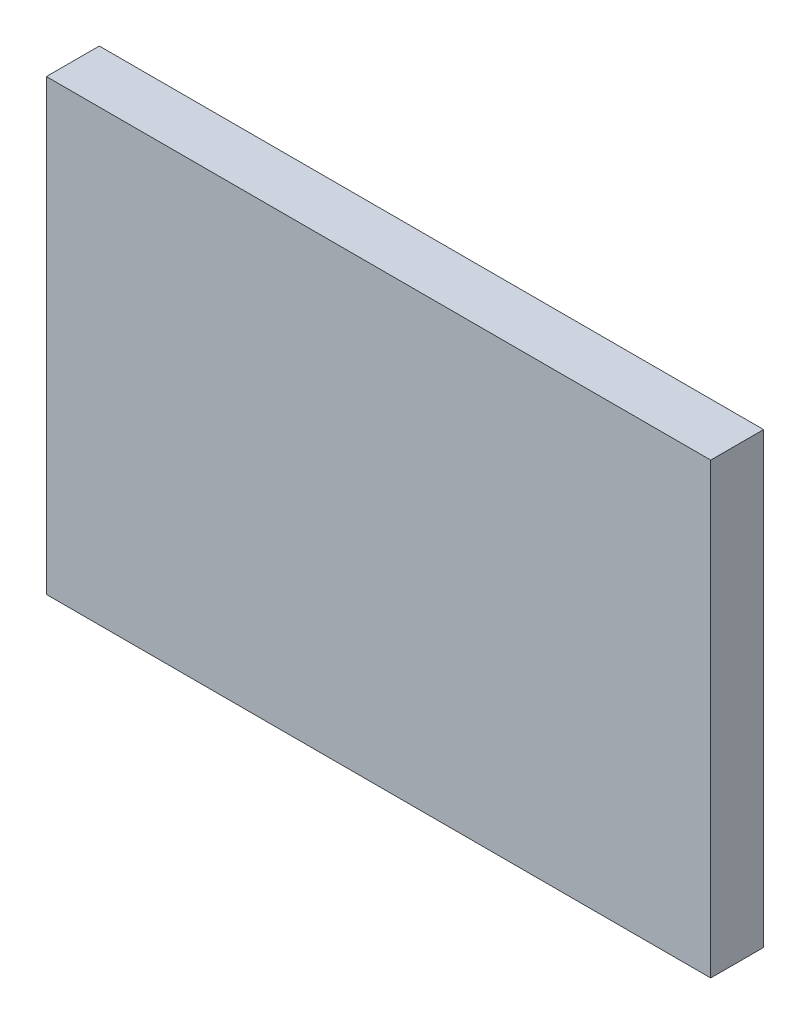
ISO-10303-21;
HEADER;
FILE_DESCRIPTION(('STEP AP214'),'2;1');
FILE_NAME('part.step','',(''),(''),'','','');
FILE_SCHEMA(('AUTOMOTIVE_DESIGN { 1 0 10303 214 1 1 1 1 }'));
ENDSEC;
DATA;
#1=APPLICATION_CONTEXT('core data for automotive mechanical design processes');
#2=APPLICATION_PROTOCOL_DEFINITION('international standard','automotive_design',2000,#1);
#3=PRODUCT_CONTEXT('',#1,'mechanical');
#4=PRODUCT('Part','Part','',(#3));
#5=PRODUCT_RELATED_PRODUCT_CATEGORY('part','',(#4));
#6=PRODUCT_DEFINITION_FORMATION('','',#4);
#7=PRODUCT_DEFINITION_CONTEXT('part definition',#1,'design');
#8=PRODUCT_DEFINITION('design','',#6,#7);
#9=PRODUCT_DEFINITION_SHAPE('','',#8);
#10=(LENGTH_UNIT() NAMED_UNIT(*) SI_UNIT(.MILLI.,.METRE.));
#11=(NAMED_UNIT(*) PLANE_ANGLE_UNIT() SI_UNIT($,.RADIAN.));
#12=(NAMED_UNIT(*) SI_UNIT($,.STERADIAN.) SOLID_ANGLE_UNIT());
#13=UNCERTAINTY_MEASURE_WITH_UNIT(LENGTH_MEASURE(1.E-05),#10,'distance_accuracy_value','');
#14=(GEOMETRIC_REPRESENTATION_CONTEXT(3) GLOBAL_UNCERTAINTY_ASSIGNED_CONTEXT((#13)) GLOBAL_UNIT_ASSIGNED_CONTEXT((#10,
#11,#12)) REPRESENTATION_CONTEXT('',''));
#15=CARTESIAN_POINT('',(0.,0.,0.));
#16=DIRECTION('',(0.,0.,1.));
#17=DIRECTION('',(1.,0.,0.));
#18=AXIS2_PLACEMENT_3D('',#15,#16,#17);
#19=CARTESIAN_POINT('',(19.939,-13.462,3.175));
#20=DIRECTION('',(-1.,0.,0.));
#21=DIRECTION('',(0.,0.,1.));
#22=AXIS2_PLACEMENT_3D('',#19,#20,#21);
#23=PLANE('',#22);
#24=DIRECTION('',(0.,1.,0.));
#25=VECTOR('',#24,1.);
#26=CARTESIAN_POINT('',(19.939,-13.462,0.));
#27=LINE('',#26,#25);
#28=CARTESIAN_POINT('',(19.939,-13.462,0.));
#29=VERTEX_POINT('',#28);
#30=CARTESIAN_POINT('',(19.939,13.462,0.));
#31=VERTEX_POINT('',#30);
#32=EDGE_CURVE('E96',#29,#31,#27,.T.);
#33=ORIENTED_EDGE('',*,*,#32,.T.);
#34=DIRECTION('',(0.,0.,-1.));
#35=VECTOR('',#34,1.);
#36=CARTESIAN_POINT('',(19.939,13.462,3.175));
#37=LINE('',#36,#35);
#38=CARTESIAN_POINT('',(19.939,13.462,3.175));
#39=VERTEX_POINT('',#38);
#40=EDGE_CURVE('E11',#39,#31,#37,.T.);
#41=ORIENTED_EDGE('',*,*,#40,.F.);
#42=DIRECTION('',(0.,1.,0.));
#43=VECTOR('',#42,1.);
#44=CARTESIAN_POINT('',(19.939,-13.462,3.175));
#45=LINE('',#44,#43);
#46=CARTESIAN_POINT('',(19.939,-13.462,3.175));
#47=VERTEX_POINT('',#46);
#48=EDGE_CURVE('E84',#47,#39,#45,.T.);
#49=ORIENTED_EDGE('',*,*,#48,.F.);
#50=DIRECTION('',(0.,0.,-1.));
#51=VECTOR('',#50,1.);
#52=CARTESIAN_POINT('',(19.939,-13.462,3.175));
#53=LINE('',#52,#51);
#54=EDGE_CURVE('E92',#47,#29,#53,.T.);
#55=ORIENTED_EDGE('',*,*,#54,.T.);
#56=EDGE_LOOP('',(#33,#41,#49,#55));
#57=FACE_BOUND('',#56,.T.);
#58=ADVANCED_FACE('F33',(#57),#23,.F.);
#59=CARTESIAN_POINT('',(-19.939,13.462,3.175));
#60=DIRECTION('',(0.,-1.,0.));
#61=DIRECTION('',(0.,0.,-1.));
#62=AXIS2_PLACEMENT_3D('',#59,#60,#61);
#63=PLANE('',#62);
#64=DIRECTION('',(-1.,0.,0.));
#65=VECTOR('',#64,1.);
#66=CARTESIAN_POINT('',(-19.939,13.462,0.));
#67=LINE('',#66,#65);
#68=CARTESIAN_POINT('',(-19.939,13.462,0.));
#69=VERTEX_POINT('',#68);
#70=EDGE_CURVE('E88',#31,#69,#67,.T.);
#71=ORIENTED_EDGE('',*,*,#70,.T.);
#72=DIRECTION('',(0.,0.,-1.));
#73=VECTOR('',#72,1.);
#74=CARTESIAN_POINT('',(-19.939,13.462,3.175));
#75=LINE('',#74,#73);
#76=CARTESIAN_POINT('',(-19.939,13.462,3.175));
#77=VERTEX_POINT('',#76);
#78=EDGE_CURVE('E41',#77,#69,#75,.T.);
#79=ORIENTED_EDGE('',*,*,#78,.F.);
#80=DIRECTION('',(-1.,0.,0.));
#81=VECTOR('',#80,1.);
#82=CARTESIAN_POINT('',(-19.939,13.462,3.175));
#83=LINE('',#82,#81);
#84=EDGE_CURVE('E79',#39,#77,#83,.T.);
#85=ORIENTED_EDGE('',*,*,#84,.F.);
#86=ORIENTED_EDGE('',*,*,#40,.T.);
#87=EDGE_LOOP('',(#71,#79,#85,#86));
#88=FACE_BOUND('',#87,.T.);
#89=ADVANCED_FACE('F87',(#88),#63,.F.);
#90=CARTESIAN_POINT('',(-19.939,-13.462,3.175));
#91=DIRECTION('',(1.,0.,0.));
#92=DIRECTION('',(0.,0.,-1.));
#93=AXIS2_PLACEMENT_3D('',#90,#91,#92);
#94=PLANE('',#93);
#95=DIRECTION('',(0.,-1.,0.));
#96=VECTOR('',#95,1.);
#97=CARTESIAN_POINT('',(-19.939,-13.462,0.));
#98=LINE('',#97,#96);
#99=CARTESIAN_POINT('',(-19.939,-13.462,0.));
#100=VERTEX_POINT('',#99);
#101=EDGE_CURVE('E66',#69,#100,#98,.T.);
#102=ORIENTED_EDGE('',*,*,#101,.T.);
#103=DIRECTION('',(0.,0.,-1.));
#104=VECTOR('',#103,1.);
#105=CARTESIAN_POINT('',(-19.939,-13.462,3.175));
#106=LINE('',#105,#104);
#107=CARTESIAN_POINT('',(-19.939,-13.462,3.175));
#108=VERTEX_POINT('',#107);
#109=EDGE_CURVE('E89',#108,#100,#106,.T.);
#110=ORIENTED_EDGE('',*,*,#109,.F.);
#111=DIRECTION('',(0.,-1.,0.));
#112=VECTOR('',#111,1.);
#113=CARTESIAN_POINT('',(-19.939,-13.462,3.175));
#114=LINE('',#113,#112);
#115=EDGE_CURVE('E82',#77,#108,#114,.T.);
#116=ORIENTED_EDGE('',*,*,#115,.F.);
#117=ORIENTED_EDGE('',*,*,#78,.T.);
#118=EDGE_LOOP('',(#102,#110,#116,#117));
#119=FACE_BOUND('',#118,.T.);
#120=ADVANCED_FACE('F90',(#119),#94,.F.);
#121=CARTESIAN_POINT('',(-19.939,-13.462,3.175));
#122=DIRECTION('',(0.,1.,0.));
#123=DIRECTION('',(0.,0.,1.));
#124=AXIS2_PLACEMENT_3D('',#121,#122,#123);
#125=PLANE('',#124);
#126=DIRECTION('',(1.,0.,0.));
#127=VECTOR('',#126,1.);
#128=CARTESIAN_POINT('',(-19.939,-13.462,0.));
#129=LINE('',#128,#127);
#130=EDGE_CURVE('E72',#100,#29,#129,.T.);
#131=ORIENTED_EDGE('',*,*,#130,.T.);
#132=ORIENTED_EDGE('',*,*,#54,.F.);
#133=DIRECTION('',(1.,0.,0.));
#134=VECTOR('',#133,1.);
#135=CARTESIAN_POINT('',(-19.939,-13.462,3.175));
#136=LINE('',#135,#134);
#137=EDGE_CURVE('E49',#108,#47,#136,.T.);
#138=ORIENTED_EDGE('',*,*,#137,.F.);
#139=ORIENTED_EDGE('',*,*,#109,.T.);
#140=EDGE_LOOP('',(#131,#132,#138,#139));
#141=FACE_BOUND('',#140,.T.);
#142=ADVANCED_FACE('F103',(#141),#125,.F.);
#143=CARTESIAN_POINT('',(0.,0.,3.175));
#144=DIRECTION('',(0.,0.,-1.));
#145=DIRECTION('',(-1.,0.,0.));
#146=AXIS2_PLACEMENT_3D('',#143,#144,#145);
#147=PLANE('',#146);
#148=ORIENTED_EDGE('',*,*,#48,.T.);
#149=ORIENTED_EDGE('',*,*,#84,.T.);
#150=ORIENTED_EDGE('',*,*,#115,.T.);
#151=ORIENTED_EDGE('',*,*,#137,.T.);
#152=EDGE_LOOP('',(#148,#149,#150,#151));
#153=FACE_BOUND('',#152,.T.);
#154=ADVANCED_FACE('F80',(#153),#147,.F.);
#155=CARTESIAN_POINT('',(0.,0.,0.));
#156=DIRECTION('',(0.,0.,-1.));
#157=DIRECTION('',(-1.,0.,0.));
#158=AXIS2_PLACEMENT_3D('',#155,#156,#157);
#159=PLANE('',#158);
#160=ORIENTED_EDGE('',*,*,#32,.F.);
#161=ORIENTED_EDGE('',*,*,#130,.F.);
#162=ORIENTED_EDGE('',*,*,#101,.F.);
#163=ORIENTED_EDGE('',*,*,#70,.F.);
#164=EDGE_LOOP('',(#160,#161,#162,#163));
#165=FACE_BOUND('',#164,.T.);
#166=ADVANCED_FACE('F106',(#165),#159,.T.);
#167=CLOSED_SHELL('',(#58,#89,#120,#142,#154,#166));
#168=MANIFOLD_SOLID_BREP('B2',#167);
#169=ADVANCED_BREP_SHAPE_REPRESENTATION('',(#18,#168),#14);
#170=SHAPE_DEFINITION_REPRESENTATION(#9,#169);
ENDSEC;
END-ISO-10303-21;
